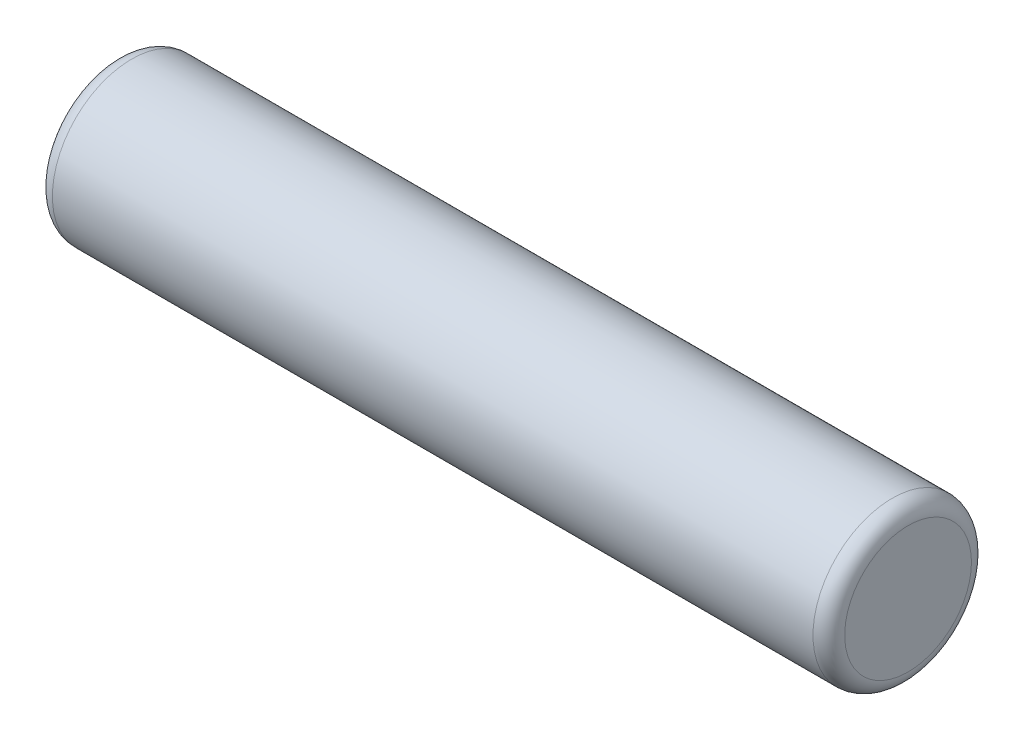
ISO-10303-21;
HEADER;
FILE_DESCRIPTION(('STEP AP214'),'2;1');
FILE_NAME('part.step','',(''),(''),'','','');
FILE_SCHEMA(('AUTOMOTIVE_DESIGN { 1 0 10303 214 1 1 1 1 }'));
ENDSEC;
DATA;
#1=APPLICATION_CONTEXT('core data for automotive mechanical design processes');
#2=APPLICATION_PROTOCOL_DEFINITION('international standard','automotive_design',2000,#1);
#3=PRODUCT_CONTEXT('',#1,'mechanical');
#4=PRODUCT('Part','Part','',(#3));
#5=PRODUCT_RELATED_PRODUCT_CATEGORY('part','',(#4));
#6=PRODUCT_DEFINITION_FORMATION('','',#4);
#7=PRODUCT_DEFINITION_CONTEXT('part definition',#1,'design');
#8=PRODUCT_DEFINITION('design','',#6,#7);
#9=PRODUCT_DEFINITION_SHAPE('','',#8);
#10=(LENGTH_UNIT() NAMED_UNIT(*) SI_UNIT(.MILLI.,.METRE.));
#11=(NAMED_UNIT(*) PLANE_ANGLE_UNIT() SI_UNIT($,.RADIAN.));
#12=(NAMED_UNIT(*) SI_UNIT($,.STERADIAN.) SOLID_ANGLE_UNIT());
#13=UNCERTAINTY_MEASURE_WITH_UNIT(LENGTH_MEASURE(1.E-05),#10,'distance_accuracy_value','');
#14=(GEOMETRIC_REPRESENTATION_CONTEXT(3) GLOBAL_UNCERTAINTY_ASSIGNED_CONTEXT((#13)) GLOBAL_UNIT_ASSIGNED_CONTEXT((#10,
#11,#12)) REPRESENTATION_CONTEXT('',''));
#15=CARTESIAN_POINT('',(0.,0.,0.));
#16=DIRECTION('',(0.,0.,1.));
#17=DIRECTION('',(1.,0.,0.));
#18=AXIS2_PLACEMENT_3D('',#15,#16,#17);
#19=CARTESIAN_POINT('',(0.,0.,0.));
#20=DIRECTION('',(1.,0.,0.));
#21=DIRECTION('',(0.,0.,-1.));
#22=AXIS2_PLACEMENT_3D('',#19,#20,#21);
#23=PLANE('',#22);
#24=CARTESIAN_POINT('',(0.,0.,0.));
#25=DIRECTION('',(1.,0.,0.));
#26=DIRECTION('',(0.,0.,-1.));
#27=AXIS2_PLACEMENT_3D('',#24,#25,#26);
#28=CIRCLE('',#27,1.91999999999992);
#29=CARTESIAN_POINT('',(0.,0.,-1.91999999999992));
#30=VERTEX_POINT('',#29);
#31=EDGE_CURVE('E30',#30,#30,#28,.T.);
#32=ORIENTED_EDGE('',*,*,#31,.F.);
#33=EDGE_LOOP('',(#32));
#34=FACE_BOUND('',#33,.T.);
#35=ADVANCED_FACE('F15',(#34),#23,.F.);
#36=CARTESIAN_POINT('',(0.480000000000078,0.,0.));
#37=DIRECTION('',(1.,0.,0.));
#38=DIRECTION('',(0.,0.,-1.));
#39=AXIS2_PLACEMENT_3D('',#36,#37,#38);
#40=TOROIDAL_SURFACE('',#39,1.91999999999992,0.480000000000078);
#41=ORIENTED_EDGE('',*,*,#31,.T.);
#42=EDGE_LOOP('',(#41));
#43=FACE_BOUND('',#42,.T.);
#44=CARTESIAN_POINT('',(0.48,0.,0.));
#45=DIRECTION('',(1.,0.,0.));
#46=DIRECTION('',(0.,0.,-1.));
#47=AXIS2_PLACEMENT_3D('',#44,#45,#46);
#48=CIRCLE('',#47,2.4);
#49=CARTESIAN_POINT('',(0.48,0.,-2.4));
#50=VERTEX_POINT('',#49);
#51=EDGE_CURVE('E26',#50,#50,#48,.T.);
#52=ORIENTED_EDGE('',*,*,#51,.F.);
#53=EDGE_LOOP('',(#52));
#54=FACE_BOUND('',#53,.T.);
#55=ADVANCED_FACE('F36',(#43,#54),#40,.T.);
#56=CARTESIAN_POINT('',(24.,0.,0.));
#57=DIRECTION('',(1.,0.,0.));
#58=DIRECTION('',(0.,0.,-1.));
#59=AXIS2_PLACEMENT_3D('',#56,#57,#58);
#60=CYLINDRICAL_SURFACE('',#59,2.4);
#61=CARTESIAN_POINT('',(23.52,0.,0.));
#62=DIRECTION('',(1.,0.,0.));
#63=DIRECTION('',(0.,0.,-1.));
#64=AXIS2_PLACEMENT_3D('',#61,#62,#63);
#65=CIRCLE('',#64,2.4);
#66=CARTESIAN_POINT('',(23.52,0.,-2.4));
#67=VERTEX_POINT('',#66);
#68=EDGE_CURVE('E22',#67,#67,#65,.T.);
#69=ORIENTED_EDGE('',*,*,#68,.F.);
#70=EDGE_LOOP('',(#69));
#71=FACE_BOUND('',#70,.T.);
#72=ORIENTED_EDGE('',*,*,#51,.T.);
#73=EDGE_LOOP('',(#72));
#74=FACE_BOUND('',#73,.T.);
#75=ADVANCED_FACE('F45',(#71,#74),#60,.T.);
#76=CARTESIAN_POINT('',(23.5200000000007,0.,0.));
#77=DIRECTION('',(1.,0.,0.));
#78=DIRECTION('',(0.,0.,-1.));
#79=AXIS2_PLACEMENT_3D('',#76,#77,#78);
#80=TOROIDAL_SURFACE('',#79,1.9200000000007,0.479999999999294);
#81=ORIENTED_EDGE('',*,*,#68,.T.);
#82=EDGE_LOOP('',(#81));
#83=FACE_BOUND('',#82,.T.);
#84=CARTESIAN_POINT('',(24.,0.,0.));
#85=DIRECTION('',(1.,0.,0.));
#86=DIRECTION('',(0.,0.,-1.));
#87=AXIS2_PLACEMENT_3D('',#84,#85,#86);
#88=CIRCLE('',#87,1.9200000000007);
#89=CARTESIAN_POINT('',(24.,0.,-1.9200000000007));
#90=VERTEX_POINT('',#89);
#91=EDGE_CURVE('E10',#90,#90,#88,.T.);
#92=ORIENTED_EDGE('',*,*,#91,.F.);
#93=EDGE_LOOP('',(#92));
#94=FACE_BOUND('',#93,.T.);
#95=ADVANCED_FACE('F49',(#83,#94),#80,.T.);
#96=CARTESIAN_POINT('',(24.,1.92,0.));
#97=DIRECTION('',(-1.,0.,0.));
#98=DIRECTION('',(0.,0.,1.));
#99=AXIS2_PLACEMENT_3D('',#96,#97,#98);
#100=PLANE('',#99);
#101=ORIENTED_EDGE('',*,*,#91,.T.);
#102=EDGE_LOOP('',(#101));
#103=FACE_BOUND('',#102,.T.);
#104=ADVANCED_FACE('F17',(#103),#100,.F.);
#105=CLOSED_SHELL('',(#35,#55,#75,#95,#104));
#106=MANIFOLD_SOLID_BREP('B1',#105);
#107=ADVANCED_BREP_SHAPE_REPRESENTATION('',(#18,#106),#14);
#108=SHAPE_DEFINITION_REPRESENTATION(#9,#107);
ENDSEC;
END-ISO-10303-21;
